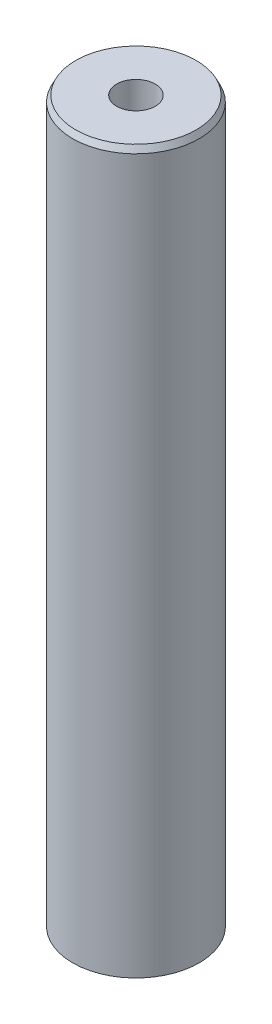
ISO-10303-21;
HEADER;
FILE_DESCRIPTION(('STEP AP214'),'2;1');
FILE_NAME('part.step','',(''),(''),'','','');
FILE_SCHEMA(('AUTOMOTIVE_DESIGN { 1 0 10303 214 1 1 1 1 }'));
ENDSEC;
DATA;
#1=APPLICATION_CONTEXT('core data for automotive mechanical design processes');
#2=APPLICATION_PROTOCOL_DEFINITION('international standard','automotive_design',2000,#1);
#3=PRODUCT_CONTEXT('',#1,'mechanical');
#4=PRODUCT('Part','Part','',(#3));
#5=PRODUCT_RELATED_PRODUCT_CATEGORY('part','',(#4));
#6=PRODUCT_DEFINITION_FORMATION('','',#4);
#7=PRODUCT_DEFINITION_CONTEXT('part definition',#1,'design');
#8=PRODUCT_DEFINITION('design','',#6,#7);
#9=PRODUCT_DEFINITION_SHAPE('','',#8);
#10=(LENGTH_UNIT() NAMED_UNIT(*) SI_UNIT(.MILLI.,.METRE.));
#11=(NAMED_UNIT(*) PLANE_ANGLE_UNIT() SI_UNIT($,.RADIAN.));
#12=(NAMED_UNIT(*) SI_UNIT($,.STERADIAN.) SOLID_ANGLE_UNIT());
#13=UNCERTAINTY_MEASURE_WITH_UNIT(LENGTH_MEASURE(1.E-05),#10,'distance_accuracy_value','');
#14=(GEOMETRIC_REPRESENTATION_CONTEXT(3) GLOBAL_UNCERTAINTY_ASSIGNED_CONTEXT((#13)) GLOBAL_UNIT_ASSIGNED_CONTEXT((#10,
#11,#12)) REPRESENTATION_CONTEXT('',''));
#15=CARTESIAN_POINT('',(0.,0.,0.));
#16=DIRECTION('',(0.,0.,1.));
#17=DIRECTION('',(1.,0.,0.));
#18=AXIS2_PLACEMENT_3D('',#15,#16,#17);
#19=CARTESIAN_POINT('',(0.,600.,0.));
#20=DIRECTION('',(0.,-1.,0.));
#21=DIRECTION('',(0.,0.,-1.));
#22=AXIS2_PLACEMENT_3D('',#19,#20,#21);
#23=CYLINDRICAL_SURFACE('',#22,52.5);
#24=CARTESIAN_POINT('',(0.,594.936488436027,0.));
#25=DIRECTION('',(0.,1.,0.));
#26=DIRECTION('',(0.,0.,1.));
#27=AXIS2_PLACEMENT_3D('',#24,#25,#26);
#28=CIRCLE('',#27,52.5);
#29=CARTESIAN_POINT('',(0.,594.936488436027,52.5));
#30=VERTEX_POINT('',#29);
#31=EDGE_CURVE('E50',#30,#30,#28,.F.);
#32=ORIENTED_EDGE('',*,*,#31,.T.);
#33=EDGE_LOOP('',(#32));
#34=FACE_BOUND('',#33,.T.);
#35=CARTESIAN_POINT('',(0.,2.52819033779028,0.));
#36=DIRECTION('',(0.,1.,0.));
#37=DIRECTION('',(0.,0.,1.));
#38=AXIS2_PLACEMENT_3D('',#35,#36,#37);
#39=CIRCLE('',#38,52.5);
#40=CARTESIAN_POINT('',(0.,2.52819033779028,52.5));
#41=VERTEX_POINT('',#40);
#42=EDGE_CURVE('E51',#41,#41,#39,.T.);
#43=ORIENTED_EDGE('',*,*,#42,.T.);
#44=EDGE_LOOP('',(#43));
#45=FACE_BOUND('',#44,.T.);
#46=ADVANCED_FACE('F39',(#34,#45),#23,.T.);
#47=CARTESIAN_POINT('',(0.,600.,0.));
#48=DIRECTION('',(0.,1.,0.));
#49=DIRECTION('',(0.,0.,1.));
#50=AXIS2_PLACEMENT_3D('',#47,#48,#49);
#51=PLANE('',#50);
#52=CARTESIAN_POINT('',(0.,600.,0.));
#53=DIRECTION('',(0.,1.,0.));
#54=DIRECTION('',(0.,0.,1.));
#55=AXIS2_PLACEMENT_3D('',#52,#53,#54);
#56=CIRCLE('',#55,49.9718096622097);
#57=CARTESIAN_POINT('',(0.,600.,49.9718096622097));
#58=VERTEX_POINT('',#57);
#59=EDGE_CURVE('E54',#58,#58,#56,.T.);
#60=ORIENTED_EDGE('',*,*,#59,.T.);
#61=EDGE_LOOP('',(#60));
#62=FACE_BOUND('',#61,.T.);
#63=CARTESIAN_POINT('',(0.,600.,0.));
#64=DIRECTION('',(0.,1.,0.));
#65=DIRECTION('',(0.,0.,1.));
#66=AXIS2_PLACEMENT_3D('',#63,#64,#65);
#67=CIRCLE('',#66,16.023131756008);
#68=CARTESIAN_POINT('',(0.,600.,16.023131756008));
#69=VERTEX_POINT('',#68);
#70=EDGE_CURVE('E58',#69,#69,#67,.T.);
#71=ORIENTED_EDGE('',*,*,#70,.F.);
#72=EDGE_LOOP('',(#71));
#73=FACE_BOUND('',#72,.T.);
#74=ADVANCED_FACE('F69',(#62,#73),#51,.T.);
#75=CARTESIAN_POINT('',(0.,0.,0.));
#76=DIRECTION('',(0.,1.,0.));
#77=DIRECTION('',(0.,0.,1.));
#78=AXIS2_PLACEMENT_3D('',#75,#76,#77);
#79=PLANE('',#78);
#80=CARTESIAN_POINT('',(0.,0.,0.));
#81=DIRECTION('',(0.,1.,0.));
#82=DIRECTION('',(0.,0.,1.));
#83=AXIS2_PLACEMENT_3D('',#80,#81,#82);
#84=CIRCLE('',#83,47.4364884360268);
#85=CARTESIAN_POINT('',(0.,0.,47.4364884360268));
#86=VERTEX_POINT('',#85);
#87=EDGE_CURVE('E10',#86,#86,#84,.F.);
#88=ORIENTED_EDGE('',*,*,#87,.T.);
#89=EDGE_LOOP('',(#88));
#90=FACE_BOUND('',#89,.T.);
#91=CARTESIAN_POINT('',(0.,0.,0.));
#92=DIRECTION('',(0.,1.,0.));
#93=DIRECTION('',(0.,0.,1.));
#94=AXIS2_PLACEMENT_3D('',#91,#92,#93);
#95=CIRCLE('',#94,16.023131756008);
#96=CARTESIAN_POINT('',(0.,0.,16.023131756008));
#97=VERTEX_POINT('',#96);
#98=EDGE_CURVE('E63',#97,#97,#95,.T.);
#99=ORIENTED_EDGE('',*,*,#98,.T.);
#100=EDGE_LOOP('',(#99));
#101=FACE_BOUND('',#100,.T.);
#102=ADVANCED_FACE('F75',(#90,#101),#79,.F.);
#103=CARTESIAN_POINT('',(0.,600.,0.));
#104=DIRECTION('',(0.,-1.,0.));
#105=DIRECTION('',(0.,0.,-1.));
#106=AXIS2_PLACEMENT_3D('',#103,#104,#105);
#107=CYLINDRICAL_SURFACE('',#106,16.023131756008);
#108=ORIENTED_EDGE('',*,*,#70,.T.);
#109=EDGE_LOOP('',(#108));
#110=FACE_BOUND('',#109,.T.);
#111=ORIENTED_EDGE('',*,*,#98,.F.);
#112=EDGE_LOOP('',(#111));
#113=FACE_BOUND('',#112,.T.);
#114=ADVANCED_FACE('F70',(#110,#113),#107,.F.);
#115=CARTESIAN_POINT('',(0.,600.,0.));
#116=DIRECTION('',(0.,-1.,0.));
#117=DIRECTION('',(0.,0.,-1.));
#118=AXIS2_PLACEMENT_3D('',#115,#116,#117);
#119=CONICAL_SURFACE('',#118,49.9718096622097,0.463084134693765);
#120=ORIENTED_EDGE('',*,*,#31,.F.);
#121=EDGE_LOOP('',(#120));
#122=FACE_BOUND('',#121,.T.);
#123=ORIENTED_EDGE('',*,*,#59,.F.);
#124=EDGE_LOOP('',(#123));
#125=FACE_BOUND('',#124,.T.);
#126=ADVANCED_FACE('F81',(#122,#125),#119,.T.);
#127=CARTESIAN_POINT('',(0.,2.52819033779028,0.));
#128=DIRECTION('',(0.,1.,0.));
#129=DIRECTION('',(0.,0.,1.));
#130=AXIS2_PLACEMENT_3D('',#127,#128,#129);
#131=CONICAL_SURFACE('',#130,52.5,1.10771219210112);
#132=ORIENTED_EDGE('',*,*,#87,.F.);
#133=EDGE_LOOP('',(#132));
#134=FACE_BOUND('',#133,.T.);
#135=ORIENTED_EDGE('',*,*,#42,.F.);
#136=EDGE_LOOP('',(#135));
#137=FACE_BOUND('',#136,.T.);
#138=ADVANCED_FACE('F45',(#134,#137),#131,.T.);
#139=CLOSED_SHELL('',(#46,#74,#102,#114,#126,#138));
#140=MANIFOLD_SOLID_BREP('B2',#139);
#141=ADVANCED_BREP_SHAPE_REPRESENTATION('',(#18,#140),#14);
#142=SHAPE_DEFINITION_REPRESENTATION(#9,#141);
ENDSEC;
END-ISO-10303-21;
